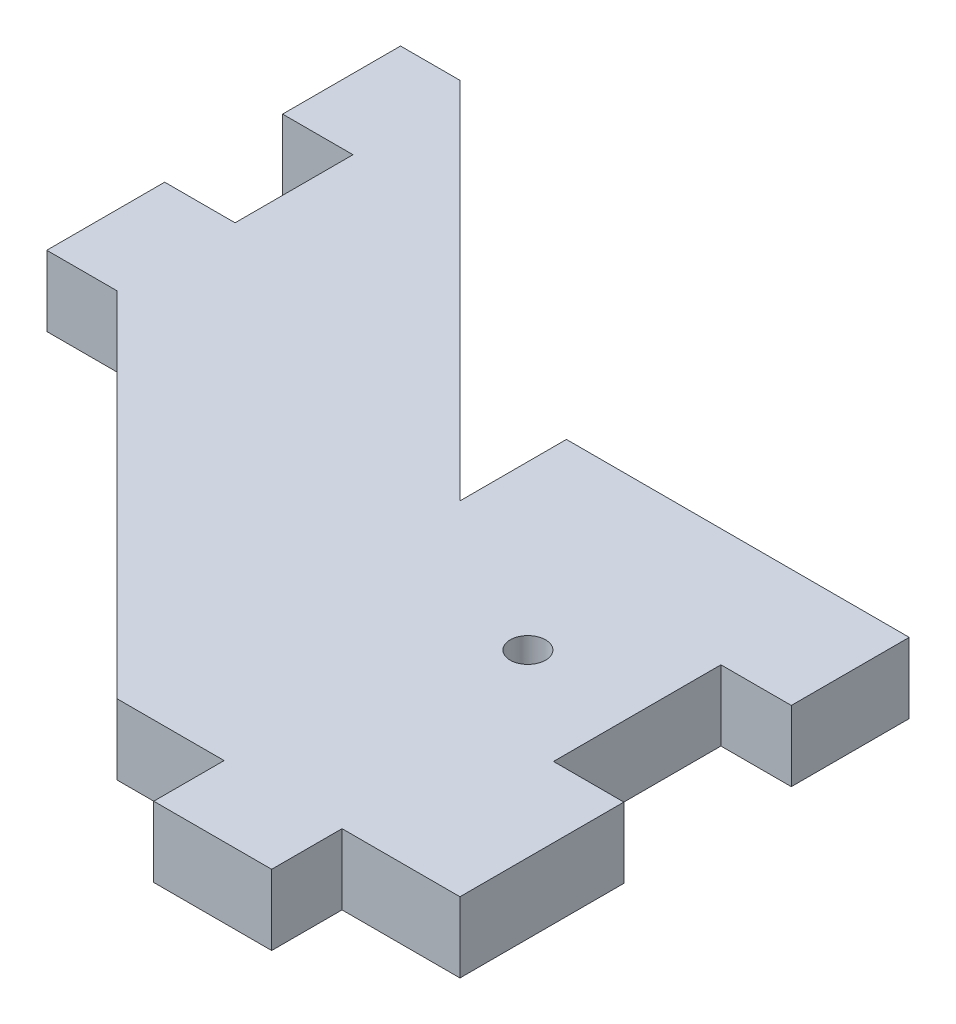
ISO-10303-21;
HEADER;
FILE_DESCRIPTION(('STEP AP214'),'2;1');
FILE_NAME('part.step','',(''),(''),'','','');
FILE_SCHEMA(('AUTOMOTIVE_DESIGN { 1 0 10303 214 1 1 1 1 }'));
ENDSEC;
DATA;
#1=APPLICATION_CONTEXT('core data for automotive mechanical design processes');
#2=APPLICATION_PROTOCOL_DEFINITION('international standard','automotive_design',2000,#1);
#3=PRODUCT_CONTEXT('',#1,'mechanical');
#4=PRODUCT('Part','Part','',(#3));
#5=PRODUCT_RELATED_PRODUCT_CATEGORY('part','',(#4));
#6=PRODUCT_DEFINITION_FORMATION('','',#4);
#7=PRODUCT_DEFINITION_CONTEXT('part definition',#1,'design');
#8=PRODUCT_DEFINITION('design','',#6,#7);
#9=PRODUCT_DEFINITION_SHAPE('','',#8);
#10=(LENGTH_UNIT() NAMED_UNIT(*) SI_UNIT(.MILLI.,.METRE.));
#11=(NAMED_UNIT(*) PLANE_ANGLE_UNIT() SI_UNIT($,.RADIAN.));
#12=(NAMED_UNIT(*) SI_UNIT($,.STERADIAN.) SOLID_ANGLE_UNIT());
#13=UNCERTAINTY_MEASURE_WITH_UNIT(LENGTH_MEASURE(1.E-05),#10,'distance_accuracy_value','');
#14=(GEOMETRIC_REPRESENTATION_CONTEXT(3) GLOBAL_UNCERTAINTY_ASSIGNED_CONTEXT((#13)) GLOBAL_UNIT_ASSIGNED_CONTEXT((#10,
#11,#12)) REPRESENTATION_CONTEXT('',''));
#15=CARTESIAN_POINT('',(0.,0.,0.));
#16=DIRECTION('',(0.,0.,1.));
#17=DIRECTION('',(1.,0.,0.));
#18=AXIS2_PLACEMENT_3D('',#15,#16,#17);
#19=CARTESIAN_POINT('',(29.9590401019999,5.969,29.959040102));
#20=DIRECTION('',(0.707106781186549,0.,-0.707106781186547));
#21=DIRECTION('',(-0.707106781186546,0.,-0.707106781186549));
#22=AXIS2_PLACEMENT_3D('',#19,#20,#21);
#23=PLANE('',#22);
#24=DIRECTION('',(0.707106781186546,0.,0.707106781186549));
#25=VECTOR('',#24,1.);
#26=CARTESIAN_POINT('',(29.9590401019999,0.,29.959040102));
#27=LINE('',#26,#25);
#28=CARTESIAN_POINT('',(0.,0.,0.));
#29=VERTEX_POINT('',#28);
#30=CARTESIAN_POINT('',(29.9590401019999,0.,29.959040102));
#31=VERTEX_POINT('',#30);
#32=EDGE_CURVE('E175',#29,#31,#27,.T.);
#33=ORIENTED_EDGE('',*,*,#32,.T.);
#34=DIRECTION('',(0.,-1.,0.));
#35=VECTOR('',#34,1.);
#36=CARTESIAN_POINT('',(29.9590401019999,5.969,29.959040102));
#37=LINE('',#36,#35);
#38=CARTESIAN_POINT('',(29.9590401019999,5.969,29.959040102));
#39=VERTEX_POINT('',#38);
#40=EDGE_CURVE('E11',#39,#31,#37,.T.);
#41=ORIENTED_EDGE('',*,*,#40,.F.);
#42=DIRECTION('',(0.707106781186546,0.,0.707106781186549));
#43=VECTOR('',#42,1.);
#44=CARTESIAN_POINT('',(29.9590401019999,5.969,29.959040102));
#45=LINE('',#44,#43);
#46=CARTESIAN_POINT('',(0.,5.969,0.));
#47=VERTEX_POINT('',#46);
#48=EDGE_CURVE('E203',#47,#39,#45,.T.);
#49=ORIENTED_EDGE('',*,*,#48,.F.);
#50=DIRECTION('',(0.,-1.,0.));
#51=VECTOR('',#50,1.);
#52=CARTESIAN_POINT('',(0.,5.969,0.));
#53=LINE('',#52,#51);
#54=EDGE_CURVE('E171',#47,#29,#53,.T.);
#55=ORIENTED_EDGE('',*,*,#54,.T.);
#56=EDGE_LOOP('',(#33,#41,#49,#55));
#57=FACE_BOUND('',#56,.T.);
#58=ADVANCED_FACE('F32',(#57),#23,.F.);
#59=CARTESIAN_POINT('',(39.031,5.969,29.959040102));
#60=DIRECTION('',(0.,0.,-1.));
#61=DIRECTION('',(-1.,0.,0.));
#62=AXIS2_PLACEMENT_3D('',#59,#60,#61);
#63=PLANE('',#62);
#64=DIRECTION('',(1.,0.,0.));
#65=VECTOR('',#64,1.);
#66=CARTESIAN_POINT('',(39.031,0.,29.959040102));
#67=LINE('',#66,#65);
#68=CARTESIAN_POINT('',(39.031,0.,29.959040102));
#69=VERTEX_POINT('',#68);
#70=EDGE_CURVE('E178',#31,#69,#67,.T.);
#71=ORIENTED_EDGE('',*,*,#70,.T.);
#72=DIRECTION('',(0.,-1.,0.));
#73=VECTOR('',#72,1.);
#74=CARTESIAN_POINT('',(39.031,5.969,29.959040102));
#75=LINE('',#74,#73);
#76=CARTESIAN_POINT('',(39.031,5.969,29.959040102));
#77=VERTEX_POINT('',#76);
#78=EDGE_CURVE('E39',#77,#69,#75,.T.);
#79=ORIENTED_EDGE('',*,*,#78,.F.);
#80=DIRECTION('',(1.,0.,0.));
#81=VECTOR('',#80,1.);
#82=CARTESIAN_POINT('',(39.031,5.969,29.959040102));
#83=LINE('',#82,#81);
#84=EDGE_CURVE('E114',#39,#77,#83,.T.);
#85=ORIENTED_EDGE('',*,*,#84,.F.);
#86=ORIENTED_EDGE('',*,*,#40,.T.);
#87=EDGE_LOOP('',(#71,#79,#85,#86));
#88=FACE_BOUND('',#87,.T.);
#89=ADVANCED_FACE('F382',(#88),#63,.F.);
#90=CARTESIAN_POINT('',(39.031,5.969,35.928040102));
#91=DIRECTION('',(1.,0.,0.));
#92=DIRECTION('',(0.,0.,-1.));
#93=AXIS2_PLACEMENT_3D('',#90,#91,#92);
#94=PLANE('',#93);
#95=DIRECTION('',(0.,0.,1.));
#96=VECTOR('',#95,1.);
#97=CARTESIAN_POINT('',(39.031,0.,35.928040102));
#98=LINE('',#97,#96);
#99=CARTESIAN_POINT('',(39.031,0.,35.928040102));
#100=VERTEX_POINT('',#99);
#101=EDGE_CURVE('E181',#69,#100,#98,.T.);
#102=ORIENTED_EDGE('',*,*,#101,.T.);
#103=DIRECTION('',(0.,-1.,0.));
#104=VECTOR('',#103,1.);
#105=CARTESIAN_POINT('',(39.031,5.969,35.928040102));
#106=LINE('',#105,#104);
#107=CARTESIAN_POINT('',(39.031,5.969,35.928040102));
#108=VERTEX_POINT('',#107);
#109=EDGE_CURVE('E228',#108,#100,#106,.T.);
#110=ORIENTED_EDGE('',*,*,#109,.F.);
#111=DIRECTION('',(0.,0.,1.));
#112=VECTOR('',#111,1.);
#113=CARTESIAN_POINT('',(39.031,5.969,35.928040102));
#114=LINE('',#113,#112);
#115=EDGE_CURVE('E236',#77,#108,#114,.T.);
#116=ORIENTED_EDGE('',*,*,#115,.F.);
#117=ORIENTED_EDGE('',*,*,#78,.T.);
#118=EDGE_LOOP('',(#102,#110,#116,#117));
#119=FACE_BOUND('',#118,.T.);
#120=ADVANCED_FACE('F234',(#119),#94,.F.);
#121=CARTESIAN_POINT('',(49.031,5.969,35.928040102));
#122=DIRECTION('',(0.,0.,-1.));
#123=DIRECTION('',(-1.,0.,0.));
#124=AXIS2_PLACEMENT_3D('',#121,#122,#123);
#125=PLANE('',#124);
#126=DIRECTION('',(1.,0.,0.));
#127=VECTOR('',#126,1.);
#128=CARTESIAN_POINT('',(49.031,0.,35.928040102));
#129=LINE('',#128,#127);
#130=CARTESIAN_POINT('',(49.031,0.,35.928040102));
#131=VERTEX_POINT('',#130);
#132=EDGE_CURVE('E183',#100,#131,#129,.T.);
#133=ORIENTED_EDGE('',*,*,#132,.T.);
#134=DIRECTION('',(0.,-1.,0.));
#135=VECTOR('',#134,1.);
#136=CARTESIAN_POINT('',(49.031,5.969,35.928040102));
#137=LINE('',#136,#135);
#138=CARTESIAN_POINT('',(49.031,5.969,35.928040102));
#139=VERTEX_POINT('',#138);
#140=EDGE_CURVE('E225',#139,#131,#137,.T.);
#141=ORIENTED_EDGE('',*,*,#140,.F.);
#142=DIRECTION('',(1.,0.,0.));
#143=VECTOR('',#142,1.);
#144=CARTESIAN_POINT('',(49.031,5.969,35.928040102));
#145=LINE('',#144,#143);
#146=EDGE_CURVE('E255',#108,#139,#145,.T.);
#147=ORIENTED_EDGE('',*,*,#146,.F.);
#148=ORIENTED_EDGE('',*,*,#109,.T.);
#149=EDGE_LOOP('',(#133,#141,#147,#148));
#150=FACE_BOUND('',#149,.T.);
#151=ADVANCED_FACE('F246',(#150),#125,.F.);
#152=CARTESIAN_POINT('',(49.031,5.969,29.959040102));
#153=DIRECTION('',(-1.,0.,0.));
#154=DIRECTION('',(0.,0.,1.));
#155=AXIS2_PLACEMENT_3D('',#152,#153,#154);
#156=PLANE('',#155);
#157=DIRECTION('',(0.,0.,-1.));
#158=VECTOR('',#157,1.);
#159=CARTESIAN_POINT('',(49.031,0.,29.959040102));
#160=LINE('',#159,#158);
#161=CARTESIAN_POINT('',(49.031,0.,29.959040102));
#162=VERTEX_POINT('',#161);
#163=EDGE_CURVE('E185',#131,#162,#160,.T.);
#164=ORIENTED_EDGE('',*,*,#163,.T.);
#165=DIRECTION('',(0.,-1.,0.));
#166=VECTOR('',#165,1.);
#167=CARTESIAN_POINT('',(49.031,5.969,29.959040102));
#168=LINE('',#167,#166);
#169=CARTESIAN_POINT('',(49.031,5.969,29.959040102));
#170=VERTEX_POINT('',#169);
#171=EDGE_CURVE('E222',#170,#162,#168,.T.);
#172=ORIENTED_EDGE('',*,*,#171,.F.);
#173=DIRECTION('',(0.,0.,-1.));
#174=VECTOR('',#173,1.);
#175=CARTESIAN_POINT('',(49.031,5.969,29.959040102));
#176=LINE('',#175,#174);
#177=EDGE_CURVE('E252',#139,#170,#176,.T.);
#178=ORIENTED_EDGE('',*,*,#177,.F.);
#179=ORIENTED_EDGE('',*,*,#140,.T.);
#180=EDGE_LOOP('',(#164,#172,#178,#179));
#181=FACE_BOUND('',#180,.T.);
#182=ADVANCED_FACE('F250',(#181),#156,.F.);
#183=CARTESIAN_POINT('',(59.031,5.969,29.959040102));
#184=DIRECTION('',(0.,0.,-1.));
#185=DIRECTION('',(-1.,0.,0.));
#186=AXIS2_PLACEMENT_3D('',#183,#184,#185);
#187=PLANE('',#186);
#188=DIRECTION('',(1.,0.,0.));
#189=VECTOR('',#188,1.);
#190=CARTESIAN_POINT('',(59.031,0.,29.959040102));
#191=LINE('',#190,#189);
#192=CARTESIAN_POINT('',(59.031,0.,29.959040102));
#193=VERTEX_POINT('',#192);
#194=EDGE_CURVE('E187',#162,#193,#191,.T.);
#195=ORIENTED_EDGE('',*,*,#194,.T.);
#196=DIRECTION('',(0.,-1.,0.));
#197=VECTOR('',#196,1.);
#198=CARTESIAN_POINT('',(59.031,5.969,29.959040102));
#199=LINE('',#198,#197);
#200=CARTESIAN_POINT('',(59.031,5.969,29.959040102));
#201=VERTEX_POINT('',#200);
#202=EDGE_CURVE('E219',#201,#193,#199,.T.);
#203=ORIENTED_EDGE('',*,*,#202,.F.);
#204=DIRECTION('',(1.,0.,0.));
#205=VECTOR('',#204,1.);
#206=CARTESIAN_POINT('',(59.031,5.969,29.959040102));
#207=LINE('',#206,#205);
#208=EDGE_CURVE('E254',#170,#201,#207,.T.);
#209=ORIENTED_EDGE('',*,*,#208,.F.);
#210=ORIENTED_EDGE('',*,*,#171,.T.);
#211=EDGE_LOOP('',(#195,#203,#209,#210));
#212=FACE_BOUND('',#211,.T.);
#213=ADVANCED_FACE('F370',(#212),#187,.F.);
#214=CARTESIAN_POINT('',(-0.92804010199981,5.969,-30.));
#215=DIRECTION('',(-0.707106781186548,0.,0.707106781186547));
#216=DIRECTION('',(0.707106781186547,0.,0.707106781186548));
#217=AXIS2_PLACEMENT_3D('',#214,#215,#216);
#218=PLANE('',#217);
#219=DIRECTION('',(-0.707106781186547,0.,-0.707106781186548));
#220=VECTOR('',#219,1.);
#221=CARTESIAN_POINT('',(-0.92804010199981,5.969,-30.));
#222=LINE('',#221,#220);
#223=CARTESIAN_POINT('',(29.9590401019999,5.969,0.887080203999798));
#224=VERTEX_POINT('',#223);
#225=CARTESIAN_POINT('',(-0.92804010199981,5.969,-30.));
#226=VERTEX_POINT('',#225);
#227=EDGE_CURVE('E46',#224,#226,#222,.T.);
#228=ORIENTED_EDGE('',*,*,#227,.F.);
#229=DIRECTION('',(0.,-1.,0.));
#230=VECTOR('',#229,1.);
#231=CARTESIAN_POINT('',(29.9590401019999,5.969,0.887080203999798));
#232=LINE('',#231,#230);
#233=CARTESIAN_POINT('',(29.9590401019999,0.,0.887080203999798));
#234=VERTEX_POINT('',#233);
#235=EDGE_CURVE('E179',#224,#234,#232,.T.);
#236=ORIENTED_EDGE('',*,*,#235,.T.);
#237=DIRECTION('',(-0.707106781186547,0.,-0.707106781186548));
#238=VECTOR('',#237,1.);
#239=CARTESIAN_POINT('',(-0.92804010199981,0.,-30.));
#240=LINE('',#239,#238);
#241=CARTESIAN_POINT('',(-0.92804010199981,0.,-30.));
#242=VERTEX_POINT('',#241);
#243=EDGE_CURVE('E189',#234,#242,#240,.T.);
#244=ORIENTED_EDGE('',*,*,#243,.T.);
#245=DIRECTION('',(0.,-1.,0.));
#246=VECTOR('',#245,1.);
#247=CARTESIAN_POINT('',(-0.92804010199981,5.969,-30.));
#248=LINE('',#247,#246);
#249=EDGE_CURVE('E216',#226,#242,#248,.T.);
#250=ORIENTED_EDGE('',*,*,#249,.F.);
#251=EDGE_LOOP('',(#228,#236,#244,#250));
#252=FACE_BOUND('',#251,.T.);
#253=ADVANCED_FACE('F372',(#252),#218,.F.);
#254=CARTESIAN_POINT('',(-5.969,5.969,-30.));
#255=DIRECTION('',(0.,0.,1.));
#256=DIRECTION('',(1.,0.,0.));
#257=AXIS2_PLACEMENT_3D('',#254,#255,#256);
#258=PLANE('',#257);
#259=DIRECTION('',(-1.,0.,0.));
#260=VECTOR('',#259,1.);
#261=CARTESIAN_POINT('',(-5.969,0.,-30.));
#262=LINE('',#261,#260);
#263=CARTESIAN_POINT('',(-5.969,0.,-30.));
#264=VERTEX_POINT('',#263);
#265=EDGE_CURVE('E191',#242,#264,#262,.T.);
#266=ORIENTED_EDGE('',*,*,#265,.T.);
#267=DIRECTION('',(0.,-1.,0.));
#268=VECTOR('',#267,1.);
#269=CARTESIAN_POINT('',(-5.969,5.969,-30.));
#270=LINE('',#269,#268);
#271=CARTESIAN_POINT('',(-5.969,5.969,-30.));
#272=VERTEX_POINT('',#271);
#273=EDGE_CURVE('E213',#272,#264,#270,.T.);
#274=ORIENTED_EDGE('',*,*,#273,.F.);
#275=DIRECTION('',(-1.,0.,0.));
#276=VECTOR('',#275,1.);
#277=CARTESIAN_POINT('',(-5.969,5.969,-30.));
#278=LINE('',#277,#276);
#279=EDGE_CURVE('E262',#226,#272,#278,.T.);
#280=ORIENTED_EDGE('',*,*,#279,.F.);
#281=ORIENTED_EDGE('',*,*,#249,.T.);
#282=EDGE_LOOP('',(#266,#274,#280,#281));
#283=FACE_BOUND('',#282,.T.);
#284=ADVANCED_FACE('F378',(#283),#258,.F.);
#285=CARTESIAN_POINT('',(-5.969,5.969,-20.));
#286=DIRECTION('',(1.,0.,0.));
#287=DIRECTION('',(0.,0.,-1.));
#288=AXIS2_PLACEMENT_3D('',#285,#286,#287);
#289=PLANE('',#288);
#290=DIRECTION('',(0.,0.,1.));
#291=VECTOR('',#290,1.);
#292=CARTESIAN_POINT('',(-5.969,0.,-20.));
#293=LINE('',#292,#291);
#294=CARTESIAN_POINT('',(-5.969,0.,-20.));
#295=VERTEX_POINT('',#294);
#296=EDGE_CURVE('E193',#264,#295,#293,.T.);
#297=ORIENTED_EDGE('',*,*,#296,.T.);
#298=DIRECTION('',(0.,-1.,0.));
#299=VECTOR('',#298,1.);
#300=CARTESIAN_POINT('',(-5.969,5.969,-20.));
#301=LINE('',#300,#299);
#302=CARTESIAN_POINT('',(-5.969,5.969,-20.));
#303=VERTEX_POINT('',#302);
#304=EDGE_CURVE('E210',#303,#295,#301,.T.);
#305=ORIENTED_EDGE('',*,*,#304,.F.);
#306=DIRECTION('',(0.,0.,1.));
#307=VECTOR('',#306,1.);
#308=CARTESIAN_POINT('',(-5.969,5.969,-20.));
#309=LINE('',#308,#307);
#310=EDGE_CURVE('E264',#272,#303,#309,.T.);
#311=ORIENTED_EDGE('',*,*,#310,.F.);
#312=ORIENTED_EDGE('',*,*,#273,.T.);
#313=EDGE_LOOP('',(#297,#305,#311,#312));
#314=FACE_BOUND('',#313,.T.);
#315=ADVANCED_FACE('F410',(#314),#289,.F.);
#316=CARTESIAN_POINT('',(0.,5.969,-20.));
#317=DIRECTION('',(0.,0.,-1.));
#318=DIRECTION('',(-1.,0.,0.));
#319=AXIS2_PLACEMENT_3D('',#316,#317,#318);
#320=PLANE('',#319);
#321=DIRECTION('',(1.,0.,0.));
#322=VECTOR('',#321,1.);
#323=CARTESIAN_POINT('',(0.,0.,-20.));
#324=LINE('',#323,#322);
#325=CARTESIAN_POINT('',(0.,0.,-20.));
#326=VERTEX_POINT('',#325);
#327=EDGE_CURVE('E195',#295,#326,#324,.T.);
#328=ORIENTED_EDGE('',*,*,#327,.T.);
#329=DIRECTION('',(0.,-1.,0.));
#330=VECTOR('',#329,1.);
#331=CARTESIAN_POINT('',(0.,5.969,-20.));
#332=LINE('',#331,#330);
#333=CARTESIAN_POINT('',(0.,5.969,-20.));
#334=VERTEX_POINT('',#333);
#335=EDGE_CURVE('E207',#334,#326,#332,.T.);
#336=ORIENTED_EDGE('',*,*,#335,.F.);
#337=DIRECTION('',(1.,0.,0.));
#338=VECTOR('',#337,1.);
#339=CARTESIAN_POINT('',(0.,5.969,-20.));
#340=LINE('',#339,#338);
#341=EDGE_CURVE('E266',#303,#334,#340,.T.);
#342=ORIENTED_EDGE('',*,*,#341,.F.);
#343=ORIENTED_EDGE('',*,*,#304,.T.);
#344=EDGE_LOOP('',(#328,#336,#342,#343));
#345=FACE_BOUND('',#344,.T.);
#346=ADVANCED_FACE('F272',(#345),#320,.F.);
#347=CARTESIAN_POINT('',(0.,5.969,-10.));
#348=DIRECTION('',(1.,0.,0.));
#349=DIRECTION('',(0.,0.,-1.));
#350=AXIS2_PLACEMENT_3D('',#347,#348,#349);
#351=PLANE('',#350);
#352=DIRECTION('',(0.,0.,1.));
#353=VECTOR('',#352,1.);
#354=CARTESIAN_POINT('',(0.,0.,-10.));
#355=LINE('',#354,#353);
#356=CARTESIAN_POINT('',(0.,0.,-10.));
#357=VERTEX_POINT('',#356);
#358=EDGE_CURVE('E197',#326,#357,#355,.T.);
#359=ORIENTED_EDGE('',*,*,#358,.T.);
#360=DIRECTION('',(0.,-1.,0.));
#361=VECTOR('',#360,1.);
#362=CARTESIAN_POINT('',(0.,5.969,-10.));
#363=LINE('',#362,#361);
#364=CARTESIAN_POINT('',(0.,5.969,-10.));
#365=VERTEX_POINT('',#364);
#366=EDGE_CURVE('E166',#365,#357,#363,.T.);
#367=ORIENTED_EDGE('',*,*,#366,.F.);
#368=DIRECTION('',(0.,0.,1.));
#369=VECTOR('',#368,1.);
#370=CARTESIAN_POINT('',(0.,5.969,-10.));
#371=LINE('',#370,#369);
#372=EDGE_CURVE('E154',#334,#365,#371,.T.);
#373=ORIENTED_EDGE('',*,*,#372,.F.);
#374=ORIENTED_EDGE('',*,*,#335,.T.);
#375=EDGE_LOOP('',(#359,#367,#373,#374));
#376=FACE_BOUND('',#375,.T.);
#377=ADVANCED_FACE('F276',(#376),#351,.F.);
#378=CARTESIAN_POINT('',(-5.969,5.969,-10.));
#379=DIRECTION('',(0.,0.,1.));
#380=DIRECTION('',(1.,0.,0.));
#381=AXIS2_PLACEMENT_3D('',#378,#379,#380);
#382=PLANE('',#381);
#383=DIRECTION('',(-1.,0.,0.));
#384=VECTOR('',#383,1.);
#385=CARTESIAN_POINT('',(-5.969,0.,-10.));
#386=LINE('',#385,#384);
#387=CARTESIAN_POINT('',(-5.969,0.,-10.));
#388=VERTEX_POINT('',#387);
#389=EDGE_CURVE('E163',#357,#388,#386,.T.);
#390=ORIENTED_EDGE('',*,*,#389,.T.);
#391=DIRECTION('',(0.,-1.,0.));
#392=VECTOR('',#391,1.);
#393=CARTESIAN_POINT('',(-5.969,5.969,-10.));
#394=LINE('',#393,#392);
#395=CARTESIAN_POINT('',(-5.969,5.969,-10.));
#396=VERTEX_POINT('',#395);
#397=EDGE_CURVE('E160',#396,#388,#394,.T.);
#398=ORIENTED_EDGE('',*,*,#397,.F.);
#399=DIRECTION('',(-1.,0.,0.));
#400=VECTOR('',#399,1.);
#401=CARTESIAN_POINT('',(-5.969,5.969,-10.));
#402=LINE('',#401,#400);
#403=EDGE_CURVE('E146',#365,#396,#402,.T.);
#404=ORIENTED_EDGE('',*,*,#403,.F.);
#405=ORIENTED_EDGE('',*,*,#366,.T.);
#406=EDGE_LOOP('',(#390,#398,#404,#405));
#407=FACE_BOUND('',#406,.T.);
#408=ADVANCED_FACE('F161',(#407),#382,.F.);
#409=CARTESIAN_POINT('',(-5.969,5.969,0.));
#410=DIRECTION('',(1.,0.,0.));
#411=DIRECTION('',(0.,0.,-1.));
#412=AXIS2_PLACEMENT_3D('',#409,#410,#411);
#413=PLANE('',#412);
#414=DIRECTION('',(0.,0.,1.));
#415=VECTOR('',#414,1.);
#416=CARTESIAN_POINT('',(-5.969,0.,0.));
#417=LINE('',#416,#415);
#418=CARTESIAN_POINT('',(-5.969,0.,0.));
#419=VERTEX_POINT('',#418);
#420=EDGE_CURVE('E200',#388,#419,#417,.T.);
#421=ORIENTED_EDGE('',*,*,#420,.T.);
#422=DIRECTION('',(0.,-1.,0.));
#423=VECTOR('',#422,1.);
#424=CARTESIAN_POINT('',(-5.969,5.969,0.));
#425=LINE('',#424,#423);
#426=CARTESIAN_POINT('',(-5.969,5.969,0.));
#427=VERTEX_POINT('',#426);
#428=EDGE_CURVE('E167',#427,#419,#425,.T.);
#429=ORIENTED_EDGE('',*,*,#428,.F.);
#430=DIRECTION('',(0.,0.,1.));
#431=VECTOR('',#430,1.);
#432=CARTESIAN_POINT('',(-5.969,5.969,0.));
#433=LINE('',#432,#431);
#434=EDGE_CURVE('E151',#396,#427,#433,.T.);
#435=ORIENTED_EDGE('',*,*,#434,.F.);
#436=ORIENTED_EDGE('',*,*,#397,.T.);
#437=EDGE_LOOP('',(#421,#429,#435,#436));
#438=FACE_BOUND('',#437,.T.);
#439=ADVANCED_FACE('F169',(#438),#413,.F.);
#440=CARTESIAN_POINT('',(0.,5.969,0.));
#441=DIRECTION('',(0.,0.,-1.));
#442=DIRECTION('',(-1.,0.,0.));
#443=AXIS2_PLACEMENT_3D('',#440,#441,#442);
#444=PLANE('',#443);
#445=DIRECTION('',(1.,0.,0.));
#446=VECTOR('',#445,1.);
#447=CARTESIAN_POINT('',(0.,0.,0.));
#448=LINE('',#447,#446);
#449=EDGE_CURVE('E106',#419,#29,#448,.T.);
#450=ORIENTED_EDGE('',*,*,#449,.T.);
#451=ORIENTED_EDGE('',*,*,#54,.F.);
#452=DIRECTION('',(1.,0.,0.));
#453=VECTOR('',#452,1.);
#454=CARTESIAN_POINT('',(0.,5.969,0.));
#455=LINE('',#454,#453);
#456=EDGE_CURVE('E55',#427,#47,#455,.T.);
#457=ORIENTED_EDGE('',*,*,#456,.F.);
#458=ORIENTED_EDGE('',*,*,#428,.T.);
#459=EDGE_LOOP('',(#450,#451,#457,#458));
#460=FACE_BOUND('',#459,.T.);
#461=ADVANCED_FACE('F277',(#460),#444,.F.);
#462=CARTESIAN_POINT('',(0.,5.969,0.));
#463=DIRECTION('',(0.,1.,0.));
#464=DIRECTION('',(0.,0.,1.));
#465=AXIS2_PLACEMENT_3D('',#462,#463,#464);
#466=PLANE('',#465);
#467=ORIENTED_EDGE('',*,*,#177,.T.);
#468=ORIENTED_EDGE('',*,*,#208,.T.);
#469=DIRECTION('',(0.,0.,-1.));
#470=VECTOR('',#469,1.);
#471=CARTESIAN_POINT('',(59.031,5.969,29.959040102));
#472=LINE('',#471,#470);
#473=CARTESIAN_POINT('',(59.031,5.969,16.059040102));
#474=VERTEX_POINT('',#473);
#475=EDGE_CURVE('E326',#201,#474,#472,.T.);
#476=ORIENTED_EDGE('',*,*,#475,.T.);
#477=DIRECTION('',(-1.,0.,0.));
#478=VECTOR('',#477,1.);
#479=CARTESIAN_POINT('',(59.031,5.969,16.059040102));
#480=LINE('',#479,#478);
#481=CARTESIAN_POINT('',(53.062,5.969,16.059040102));
#482=VERTEX_POINT('',#481);
#483=EDGE_CURVE('E323',#474,#482,#480,.T.);
#484=ORIENTED_EDGE('',*,*,#483,.T.);
#485=DIRECTION('',(0.,0.,-1.));
#486=VECTOR('',#485,1.);
#487=CARTESIAN_POINT('',(53.062,5.969,16.059040102));
#488=LINE('',#487,#486);
#489=CARTESIAN_POINT('',(53.062,5.969,1.85904010199998));
#490=VERTEX_POINT('',#489);
#491=EDGE_CURVE('E320',#482,#490,#488,.T.);
#492=ORIENTED_EDGE('',*,*,#491,.T.);
#493=DIRECTION('',(1.,0.,0.));
#494=VECTOR('',#493,1.);
#495=CARTESIAN_POINT('',(59.031,5.969,1.85904010199998));
#496=LINE('',#495,#494);
#497=CARTESIAN_POINT('',(59.031,5.969,1.85904010199998));
#498=VERTEX_POINT('',#497);
#499=EDGE_CURVE('E317',#490,#498,#496,.T.);
#500=ORIENTED_EDGE('',*,*,#499,.T.);
#501=DIRECTION('',(0.,0.,-1.));
#502=VECTOR('',#501,1.);
#503=CARTESIAN_POINT('',(59.031,5.969,1.85904010199998));
#504=LINE('',#503,#502);
#505=CARTESIAN_POINT('',(59.031,5.969,-8.14095989800003));
#506=VERTEX_POINT('',#505);
#507=EDGE_CURVE('E314',#498,#506,#504,.T.);
#508=ORIENTED_EDGE('',*,*,#507,.T.);
#509=DIRECTION('',(-1.,0.,0.));
#510=VECTOR('',#509,1.);
#511=CARTESIAN_POINT('',(59.031,5.969,-8.14095989800003));
#512=LINE('',#511,#510);
#513=CARTESIAN_POINT('',(29.9590401019999,5.969,-8.14095989800001));
#514=VERTEX_POINT('',#513);
#515=EDGE_CURVE('E311',#506,#514,#512,.T.);
#516=ORIENTED_EDGE('',*,*,#515,.T.);
#517=DIRECTION('',(0.,0.,1.));
#518=VECTOR('',#517,1.);
#519=CARTESIAN_POINT('',(29.9590401019999,5.969,29.959040102));
#520=LINE('',#519,#518);
#521=EDGE_CURVE('E293',#514,#224,#520,.T.);
#522=ORIENTED_EDGE('',*,*,#521,.T.);
#523=ORIENTED_EDGE('',*,*,#227,.T.);
#524=ORIENTED_EDGE('',*,*,#279,.T.);
#525=ORIENTED_EDGE('',*,*,#310,.T.);
#526=ORIENTED_EDGE('',*,*,#341,.T.);
#527=ORIENTED_EDGE('',*,*,#372,.T.);
#528=ORIENTED_EDGE('',*,*,#403,.T.);
#529=ORIENTED_EDGE('',*,*,#434,.T.);
#530=ORIENTED_EDGE('',*,*,#456,.T.);
#531=ORIENTED_EDGE('',*,*,#48,.T.);
#532=ORIENTED_EDGE('',*,*,#84,.T.);
#533=ORIENTED_EDGE('',*,*,#115,.T.);
#534=ORIENTED_EDGE('',*,*,#146,.T.);
#535=EDGE_LOOP('',(#467,#468,#476,#484,#492,#500,#508,#516,#522,#523,#524,#525,#526,#527,#528,
#529,#530,#531,#532,#533,#534));
#536=FACE_BOUND('',#535,.T.);
#537=CARTESIAN_POINT('',(43.791,5.969,8.95904010199998));
#538=DIRECTION('',(0.,1.,0.));
#539=DIRECTION('',(0.,0.,1.));
#540=AXIS2_PLACEMENT_3D('',#537,#538,#539);
#541=CIRCLE('',#540,1.5);
#542=CARTESIAN_POINT('',(43.791,5.969,10.459040102));
#543=VERTEX_POINT('',#542);
#544=EDGE_CURVE('E329',#543,#543,#541,.T.);
#545=ORIENTED_EDGE('',*,*,#544,.F.);
#546=EDGE_LOOP('',(#545));
#547=FACE_BOUND('',#546,.T.);
#548=ADVANCED_FACE('F148',(#536,#547),#466,.T.);
#549=CARTESIAN_POINT('',(0.,0.,0.));
#550=DIRECTION('',(0.,1.,0.));
#551=DIRECTION('',(0.,0.,1.));
#552=AXIS2_PLACEMENT_3D('',#549,#550,#551);
#553=PLANE('',#552);
#554=ORIENTED_EDGE('',*,*,#101,.F.);
#555=ORIENTED_EDGE('',*,*,#70,.F.);
#556=ORIENTED_EDGE('',*,*,#32,.F.);
#557=ORIENTED_EDGE('',*,*,#449,.F.);
#558=ORIENTED_EDGE('',*,*,#420,.F.);
#559=ORIENTED_EDGE('',*,*,#389,.F.);
#560=ORIENTED_EDGE('',*,*,#358,.F.);
#561=ORIENTED_EDGE('',*,*,#327,.F.);
#562=ORIENTED_EDGE('',*,*,#296,.F.);
#563=ORIENTED_EDGE('',*,*,#265,.F.);
#564=ORIENTED_EDGE('',*,*,#243,.F.);
#565=DIRECTION('',(0.,0.,-1.));
#566=VECTOR('',#565,1.);
#567=CARTESIAN_POINT('',(29.9590401019999,0.,29.959040102));
#568=LINE('',#567,#566);
#569=CARTESIAN_POINT('',(29.9590401019999,0.,-8.14095989800001));
#570=VERTEX_POINT('',#569);
#571=EDGE_CURVE('E335',#234,#570,#568,.T.);
#572=ORIENTED_EDGE('',*,*,#571,.T.);
#573=DIRECTION('',(1.,0.,0.));
#574=VECTOR('',#573,1.);
#575=CARTESIAN_POINT('',(59.031,0.,-8.14095989800003));
#576=LINE('',#575,#574);
#577=CARTESIAN_POINT('',(59.031,0.,-8.14095989800003));
#578=VERTEX_POINT('',#577);
#579=EDGE_CURVE('E338',#570,#578,#576,.T.);
#580=ORIENTED_EDGE('',*,*,#579,.T.);
#581=DIRECTION('',(0.,0.,1.));
#582=VECTOR('',#581,1.);
#583=CARTESIAN_POINT('',(59.031,0.,1.85904010199998));
#584=LINE('',#583,#582);
#585=CARTESIAN_POINT('',(59.031,0.,1.85904010199998));
#586=VERTEX_POINT('',#585);
#587=EDGE_CURVE('E341',#578,#586,#584,.T.);
#588=ORIENTED_EDGE('',*,*,#587,.T.);
#589=DIRECTION('',(-1.,0.,0.));
#590=VECTOR('',#589,1.);
#591=CARTESIAN_POINT('',(59.031,0.,1.85904010199998));
#592=LINE('',#591,#590);
#593=CARTESIAN_POINT('',(53.062,0.,1.85904010199998));
#594=VERTEX_POINT('',#593);
#595=EDGE_CURVE('E344',#586,#594,#592,.T.);
#596=ORIENTED_EDGE('',*,*,#595,.T.);
#597=DIRECTION('',(0.,0.,1.));
#598=VECTOR('',#597,1.);
#599=CARTESIAN_POINT('',(53.062,0.,16.059040102));
#600=LINE('',#599,#598);
#601=CARTESIAN_POINT('',(53.062,0.,16.059040102));
#602=VERTEX_POINT('',#601);
#603=EDGE_CURVE('E308',#594,#602,#600,.T.);
#604=ORIENTED_EDGE('',*,*,#603,.T.);
#605=DIRECTION('',(1.,0.,0.));
#606=VECTOR('',#605,1.);
#607=CARTESIAN_POINT('',(59.031,0.,16.059040102));
#608=LINE('',#607,#606);
#609=CARTESIAN_POINT('',(59.031,0.,16.059040102));
#610=VERTEX_POINT('',#609);
#611=EDGE_CURVE('E288',#602,#610,#608,.T.);
#612=ORIENTED_EDGE('',*,*,#611,.T.);
#613=DIRECTION('',(0.,0.,1.));
#614=VECTOR('',#613,1.);
#615=CARTESIAN_POINT('',(59.031,0.,29.959040102));
#616=LINE('',#615,#614);
#617=EDGE_CURVE('E332',#610,#193,#616,.T.);
#618=ORIENTED_EDGE('',*,*,#617,.T.);
#619=ORIENTED_EDGE('',*,*,#194,.F.);
#620=ORIENTED_EDGE('',*,*,#163,.F.);
#621=ORIENTED_EDGE('',*,*,#132,.F.);
#622=EDGE_LOOP('',(#554,#555,#556,#557,#558,#559,#560,#561,#562,#563,#564,#572,#580,#588,#596,
#604,#612,#618,#619,#620,#621));
#623=FACE_BOUND('',#622,.T.);
#624=CARTESIAN_POINT('',(43.791,0.,8.95904010199998));
#625=DIRECTION('',(0.,1.,0.));
#626=DIRECTION('',(0.,0.,1.));
#627=AXIS2_PLACEMENT_3D('',#624,#625,#626);
#628=CIRCLE('',#627,1.5);
#629=CARTESIAN_POINT('',(43.791,0.,10.459040102));
#630=VERTEX_POINT('',#629);
#631=EDGE_CURVE('E285',#630,#630,#628,.F.);
#632=ORIENTED_EDGE('',*,*,#631,.F.);
#633=EDGE_LOOP('',(#632));
#634=FACE_BOUND('',#633,.T.);
#635=ADVANCED_FACE('F239',(#623,#634),#553,.F.);
#636=CARTESIAN_POINT('',(29.9590401019999,-47.9248250107491,29.959040102));
#637=DIRECTION('',(-1.,0.,0.));
#638=DIRECTION('',(0.,0.,1.));
#639=AXIS2_PLACEMENT_3D('',#636,#637,#638);
#640=PLANE('',#639);
#641=ORIENTED_EDGE('',*,*,#235,.F.);
#642=ORIENTED_EDGE('',*,*,#521,.F.);
#643=DIRECTION('',(0.,1.,0.));
#644=VECTOR('',#643,1.);
#645=CARTESIAN_POINT('',(29.9590401019999,-47.9248250107491,-8.14095989800001));
#646=LINE('',#645,#644);
#647=EDGE_CURVE('E305',#570,#514,#646,.T.);
#648=ORIENTED_EDGE('',*,*,#647,.F.);
#649=ORIENTED_EDGE('',*,*,#571,.F.);
#650=EDGE_LOOP('',(#641,#642,#648,#649));
#651=FACE_BOUND('',#650,.T.);
#652=ADVANCED_FACE('F488',(#651),#640,.T.);
#653=CARTESIAN_POINT('',(59.031,-47.9248250107491,16.059040102));
#654=DIRECTION('',(0.,0.,-1.));
#655=DIRECTION('',(-1.,0.,0.));
#656=AXIS2_PLACEMENT_3D('',#653,#654,#655);
#657=PLANE('',#656);
#658=ORIENTED_EDGE('',*,*,#611,.F.);
#659=DIRECTION('',(0.,1.,0.));
#660=VECTOR('',#659,1.);
#661=CARTESIAN_POINT('',(53.062,-47.9248250107491,16.059040102));
#662=LINE('',#661,#660);
#663=EDGE_CURVE('E292',#602,#482,#662,.T.);
#664=ORIENTED_EDGE('',*,*,#663,.T.);
#665=ORIENTED_EDGE('',*,*,#483,.F.);
#666=DIRECTION('',(0.,1.,0.));
#667=VECTOR('',#666,1.);
#668=CARTESIAN_POINT('',(59.031,-47.9248250107491,16.059040102));
#669=LINE('',#668,#667);
#670=EDGE_CURVE('E289',#610,#474,#669,.T.);
#671=ORIENTED_EDGE('',*,*,#670,.F.);
#672=EDGE_LOOP('',(#658,#664,#665,#671));
#673=FACE_BOUND('',#672,.T.);
#674=ADVANCED_FACE('F365',(#673),#657,.T.);
#675=CARTESIAN_POINT('',(53.062,-47.9248250107491,16.059040102));
#676=DIRECTION('',(1.,0.,0.));
#677=DIRECTION('',(0.,0.,-1.));
#678=AXIS2_PLACEMENT_3D('',#675,#676,#677);
#679=PLANE('',#678);
#680=ORIENTED_EDGE('',*,*,#603,.F.);
#681=DIRECTION('',(0.,1.,0.));
#682=VECTOR('',#681,1.);
#683=CARTESIAN_POINT('',(53.062,-47.9248250107491,1.85904010199998));
#684=LINE('',#683,#682);
#685=EDGE_CURVE('E296',#594,#490,#684,.T.);
#686=ORIENTED_EDGE('',*,*,#685,.T.);
#687=ORIENTED_EDGE('',*,*,#491,.F.);
#688=ORIENTED_EDGE('',*,*,#663,.F.);
#689=EDGE_LOOP('',(#680,#686,#687,#688));
#690=FACE_BOUND('',#689,.T.);
#691=ADVANCED_FACE('F506',(#690),#679,.T.);
#692=CARTESIAN_POINT('',(59.031,-47.9248250107491,1.85904010199998));
#693=DIRECTION('',(0.,0.,1.));
#694=DIRECTION('',(1.,0.,0.));
#695=AXIS2_PLACEMENT_3D('',#692,#693,#694);
#696=PLANE('',#695);
#697=ORIENTED_EDGE('',*,*,#595,.F.);
#698=DIRECTION('',(0.,1.,0.));
#699=VECTOR('',#698,1.);
#700=CARTESIAN_POINT('',(59.031,-47.9248250107491,1.85904010199998));
#701=LINE('',#700,#699);
#702=EDGE_CURVE('E299',#586,#498,#701,.T.);
#703=ORIENTED_EDGE('',*,*,#702,.T.);
#704=ORIENTED_EDGE('',*,*,#499,.F.);
#705=ORIENTED_EDGE('',*,*,#685,.F.);
#706=EDGE_LOOP('',(#697,#703,#704,#705));
#707=FACE_BOUND('',#706,.T.);
#708=ADVANCED_FACE('F515',(#707),#696,.T.);
#709=CARTESIAN_POINT('',(59.031,-47.9248250107491,1.85904010199998));
#710=DIRECTION('',(1.,0.,0.));
#711=DIRECTION('',(0.,0.,-1.));
#712=AXIS2_PLACEMENT_3D('',#709,#710,#711);
#713=PLANE('',#712);
#714=ORIENTED_EDGE('',*,*,#587,.F.);
#715=DIRECTION('',(0.,1.,0.));
#716=VECTOR('',#715,1.);
#717=CARTESIAN_POINT('',(59.031,-47.9248250107491,-8.14095989800003));
#718=LINE('',#717,#716);
#719=EDGE_CURVE('E302',#578,#506,#718,.T.);
#720=ORIENTED_EDGE('',*,*,#719,.T.);
#721=ORIENTED_EDGE('',*,*,#507,.F.);
#722=ORIENTED_EDGE('',*,*,#702,.F.);
#723=EDGE_LOOP('',(#714,#720,#721,#722));
#724=FACE_BOUND('',#723,.T.);
#725=ADVANCED_FACE('F525',(#724),#713,.T.);
#726=CARTESIAN_POINT('',(59.031,-47.9248250107491,-8.14095989800003));
#727=DIRECTION('',(0.,0.,-1.));
#728=DIRECTION('',(-1.,0.,0.));
#729=AXIS2_PLACEMENT_3D('',#726,#727,#728);
#730=PLANE('',#729);
#731=ORIENTED_EDGE('',*,*,#579,.F.);
#732=ORIENTED_EDGE('',*,*,#647,.T.);
#733=ORIENTED_EDGE('',*,*,#515,.F.);
#734=ORIENTED_EDGE('',*,*,#719,.F.);
#735=EDGE_LOOP('',(#731,#732,#733,#734));
#736=FACE_BOUND('',#735,.T.);
#737=ADVANCED_FACE('F535',(#736),#730,.T.);
#738=CARTESIAN_POINT('',(59.031,-47.9248250107491,29.959040102));
#739=DIRECTION('',(1.,0.,0.));
#740=DIRECTION('',(0.,0.,-1.));
#741=AXIS2_PLACEMENT_3D('',#738,#739,#740);
#742=PLANE('',#741);
#743=ORIENTED_EDGE('',*,*,#617,.F.);
#744=ORIENTED_EDGE('',*,*,#670,.T.);
#745=ORIENTED_EDGE('',*,*,#475,.F.);
#746=ORIENTED_EDGE('',*,*,#202,.T.);
#747=EDGE_LOOP('',(#743,#744,#745,#746));
#748=FACE_BOUND('',#747,.T.);
#749=ADVANCED_FACE('F360',(#748),#742,.T.);
#750=CARTESIAN_POINT('',(43.791,-47.9248250107491,8.95904010199998));
#751=DIRECTION('',(0.,1.,0.));
#752=DIRECTION('',(0.,0.,1.));
#753=AXIS2_PLACEMENT_3D('',#750,#751,#752);
#754=CYLINDRICAL_SURFACE('',#753,1.5);
#755=ORIENTED_EDGE('',*,*,#631,.T.);
#756=EDGE_LOOP('',(#755));
#757=FACE_BOUND('',#756,.T.);
#758=ORIENTED_EDGE('',*,*,#544,.T.);
#759=EDGE_LOOP('',(#758));
#760=FACE_BOUND('',#759,.T.);
#761=ADVANCED_FACE('F554',(#757,#760),#754,.F.);
#762=CLOSED_SHELL('',(#58,#89,#120,#151,#182,#213,#253,#284,#315,#346,#377,#408,#439,#461,#548,
#635,#652,#674,#691,#708,#725,#737,#749,#761));
#763=MANIFOLD_SOLID_BREP('B2',#762);
#764=ADVANCED_BREP_SHAPE_REPRESENTATION('',(#18,#763),#14);
#765=SHAPE_DEFINITION_REPRESENTATION(#9,#764);
ENDSEC;
END-ISO-10303-21;
